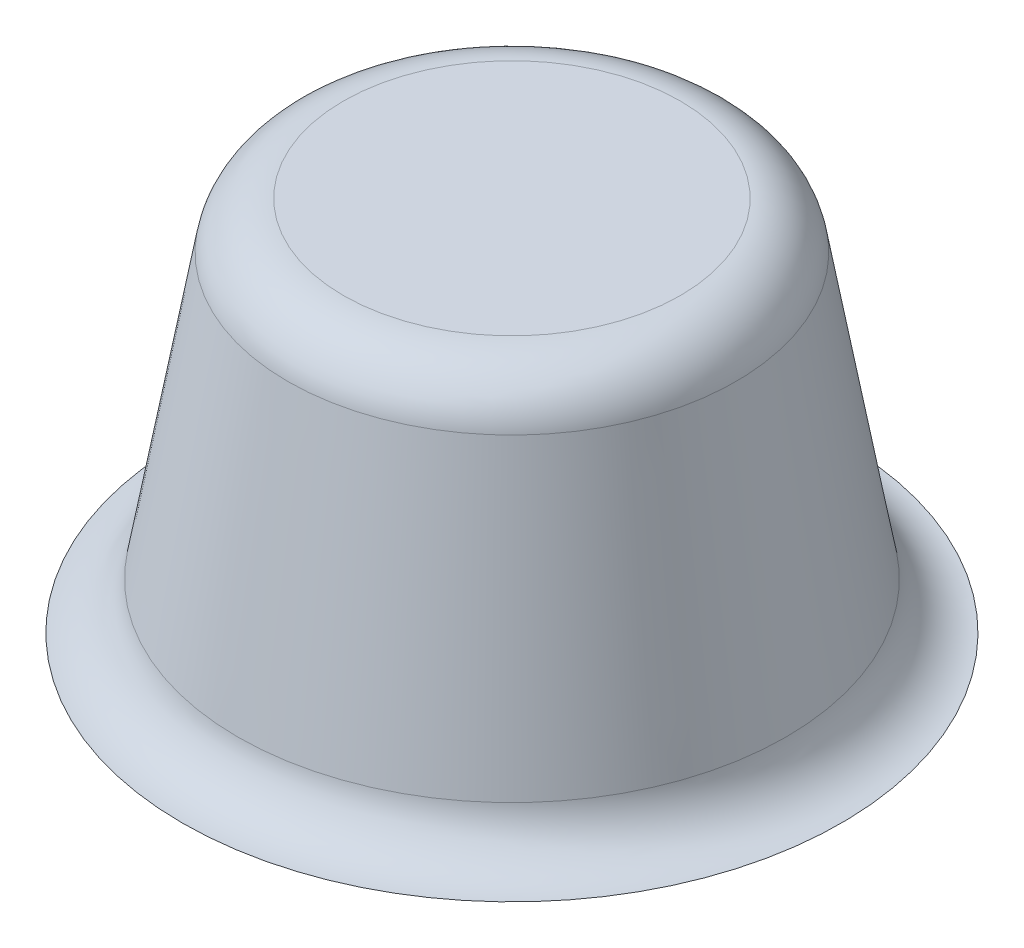
ISO-10303-21;
HEADER;
FILE_DESCRIPTION(('STEP AP214'),'2;1');
FILE_NAME('part.step','',(''),(''),'','','');
FILE_SCHEMA(('AUTOMOTIVE_DESIGN { 1 0 10303 214 1 1 1 1 }'));
ENDSEC;
DATA;
#1=APPLICATION_CONTEXT('core data for automotive mechanical design processes');
#2=APPLICATION_PROTOCOL_DEFINITION('international standard','automotive_design',2000,#1);
#3=PRODUCT_CONTEXT('',#1,'mechanical');
#4=PRODUCT('Part','Part','',(#3));
#5=PRODUCT_RELATED_PRODUCT_CATEGORY('part','',(#4));
#6=PRODUCT_DEFINITION_FORMATION('','',#4);
#7=PRODUCT_DEFINITION_CONTEXT('part definition',#1,'design');
#8=PRODUCT_DEFINITION('design','',#6,#7);
#9=PRODUCT_DEFINITION_SHAPE('','',#8);
#10=(LENGTH_UNIT() NAMED_UNIT(*) SI_UNIT(.MILLI.,.METRE.));
#11=(NAMED_UNIT(*) PLANE_ANGLE_UNIT() SI_UNIT($,.RADIAN.));
#12=(NAMED_UNIT(*) SI_UNIT($,.STERADIAN.) SOLID_ANGLE_UNIT());
#13=UNCERTAINTY_MEASURE_WITH_UNIT(LENGTH_MEASURE(1.E-05),#10,'distance_accuracy_value','');
#14=(GEOMETRIC_REPRESENTATION_CONTEXT(3) GLOBAL_UNCERTAINTY_ASSIGNED_CONTEXT((#13)) GLOBAL_UNIT_ASSIGNED_CONTEXT((#10,
#11,#12)) REPRESENTATION_CONTEXT('',''));
#15=CARTESIAN_POINT('',(0.,0.,0.));
#16=DIRECTION('',(0.,0.,1.));
#17=DIRECTION('',(1.,0.,0.));
#18=AXIS2_PLACEMENT_3D('',#15,#16,#17);
#19=CARTESIAN_POINT('',(0.,0.,0.));
#20=DIRECTION('',(0.,-1.,0.));
#21=DIRECTION('',(0.,0.,1.));
#22=AXIS2_PLACEMENT_3D('',#19,#20,#21);
#23=CONICAL_SURFACE('',#22,7.5,0.174532925199433);
#24=CARTESIAN_POINT('',(0.,1.2395277334996,0.));
#25=DIRECTION('',(0.,1.,0.));
#26=DIRECTION('',(0.,0.,1.));
#27=AXIS2_PLACEMENT_3D('',#24,#25,#26);
#28=CIRCLE('',#27,7.28143781724761);
#29=CARTESIAN_POINT('',(0.,1.2395277334996,7.28143781724761));
#30=VERTEX_POINT('',#29);
#31=EDGE_CURVE('E45',#30,#30,#28,.T.);
#32=ORIENTED_EDGE('',*,*,#31,.T.);
#33=EDGE_LOOP('',(#32));
#34=FACE_BOUND('',#33,.T.);
#35=CARTESIAN_POINT('',(0.,8.7604722665004,0.));
#36=DIRECTION('',(0.,-1.,0.));
#37=DIRECTION('',(0.,0.,-1.));
#38=AXIS2_PLACEMENT_3D('',#35,#36,#37);
#39=CIRCLE('',#38,5.95529237566774);
#40=CARTESIAN_POINT('',(0.,8.7604722665004,-5.95529237566774));
#41=VERTEX_POINT('',#40);
#42=EDGE_CURVE('E49',#41,#41,#39,.T.);
#43=ORIENTED_EDGE('',*,*,#42,.T.);
#44=EDGE_LOOP('',(#43));
#45=FACE_BOUND('',#44,.T.);
#46=ADVANCED_FACE('F34',(#34,#45),#23,.T.);
#47=CARTESIAN_POINT('',(0.,10.,0.));
#48=DIRECTION('',(0.,1.,0.));
#49=DIRECTION('',(0.,0.,1.));
#50=AXIS2_PLACEMENT_3D('',#47,#48,#49);
#51=PLANE('',#50);
#52=CARTESIAN_POINT('',(0.,10.,0.));
#53=DIRECTION('',(0.,1.,0.));
#54=DIRECTION('',(0.,0.,1.));
#55=AXIS2_PLACEMENT_3D('',#52,#53,#54);
#56=CIRCLE('',#55,4.47808074614943);
#57=CARTESIAN_POINT('',(0.,10.,4.47808074614943));
#58=VERTEX_POINT('',#57);
#59=EDGE_CURVE('E11',#58,#58,#56,.T.);
#60=ORIENTED_EDGE('',*,*,#59,.T.);
#61=EDGE_LOOP('',(#60));
#62=FACE_BOUND('',#61,.T.);
#63=ADVANCED_FACE('F65',(#62),#51,.T.);
#64=CARTESIAN_POINT('',(0.,1.5,0.));
#65=DIRECTION('',(0.,1.,0.));
#66=DIRECTION('',(0.,0.,1.));
#67=AXIS2_PLACEMENT_3D('',#64,#65,#66);
#68=TOROIDAL_SURFACE('',#67,8.75864944676592,1.5);
#69=CARTESIAN_POINT('',(0.,0.,0.));
#70=DIRECTION('',(0.,1.,0.));
#71=DIRECTION('',(0.,0.,1.));
#72=AXIS2_PLACEMENT_3D('',#69,#70,#71);
#73=CIRCLE('',#72,8.75864944676592);
#74=CARTESIAN_POINT('',(0.,0.,8.75864944676592));
#75=VERTEX_POINT('',#74);
#76=EDGE_CURVE('E41',#75,#75,#73,.F.);
#77=ORIENTED_EDGE('',*,*,#76,.F.);
#78=EDGE_LOOP('',(#77));
#79=FACE_BOUND('',#78,.T.);
#80=ORIENTED_EDGE('',*,*,#31,.F.);
#81=EDGE_LOOP('',(#80));
#82=FACE_BOUND('',#81,.T.);
#83=ADVANCED_FACE('F59',(#79,#82),#68,.F.);
#84=CARTESIAN_POINT('',(0.,8.5,0.));
#85=DIRECTION('',(0.,1.,0.));
#86=DIRECTION('',(0.,0.,1.));
#87=AXIS2_PLACEMENT_3D('',#84,#85,#86);
#88=TOROIDAL_SURFACE('',#87,4.47808074614943,1.5);
#89=ORIENTED_EDGE('',*,*,#42,.F.);
#90=EDGE_LOOP('',(#89));
#91=FACE_BOUND('',#90,.T.);
#92=ORIENTED_EDGE('',*,*,#59,.F.);
#93=EDGE_LOOP('',(#92));
#94=FACE_BOUND('',#93,.T.);
#95=ADVANCED_FACE('F36',(#91,#94),#88,.T.);
#96=CARTESIAN_POINT('',(0.,0.,0.));
#97=DIRECTION('',(0.,1.,0.));
#98=DIRECTION('',(0.,0.,1.));
#99=AXIS2_PLACEMENT_3D('',#96,#97,#98);
#100=PLANE('',#99);
#101=ORIENTED_EDGE('',*,*,#76,.T.);
#102=EDGE_LOOP('',(#101));
#103=FACE_BOUND('',#102,.T.);
#104=ADVANCED_FACE('F58',(#103),#100,.F.);
#105=CLOSED_SHELL('',(#46,#63,#83,#95,#104));
#106=MANIFOLD_SOLID_BREP('B2',#105);
#107=ADVANCED_BREP_SHAPE_REPRESENTATION('',(#18,#106),#14);
#108=SHAPE_DEFINITION_REPRESENTATION(#9,#107);
ENDSEC;
END-ISO-10303-21;
